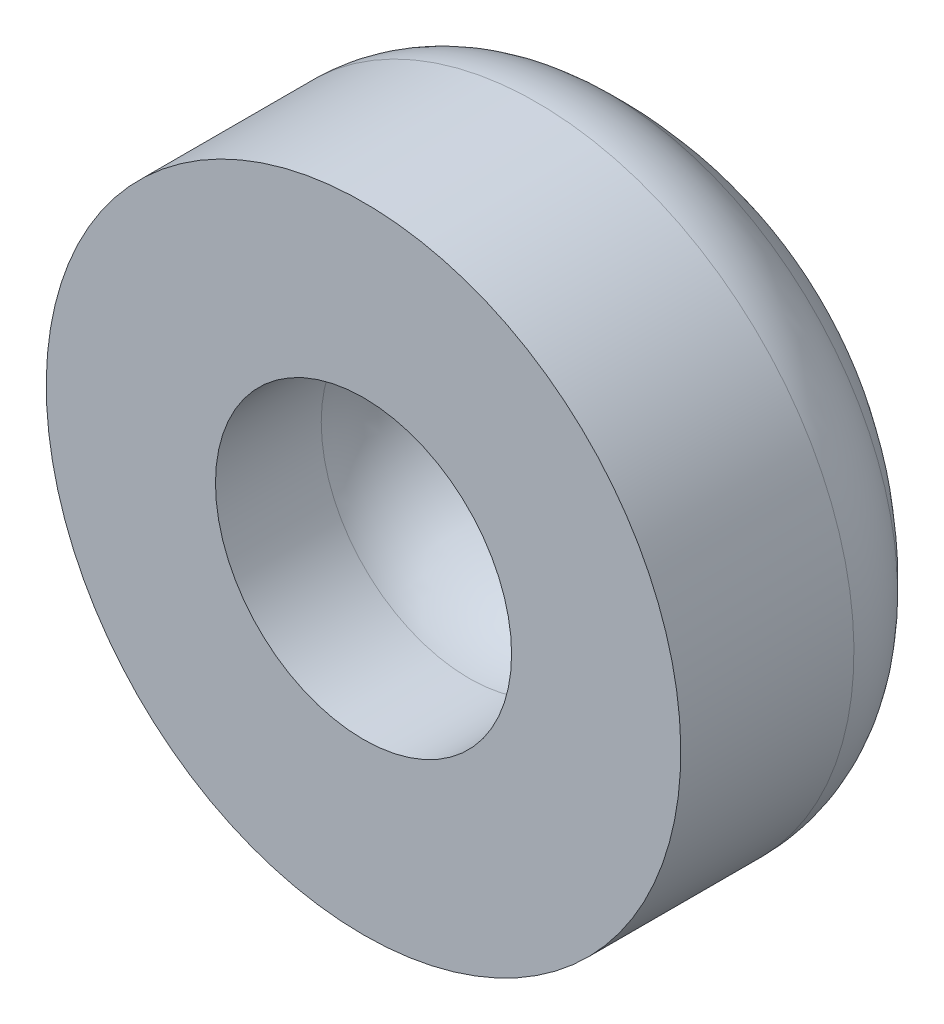
ISO-10303-21;
HEADER;
FILE_DESCRIPTION(('STEP AP214'),'2;1');
FILE_NAME('part.step','',(''),(''),'','','');
FILE_SCHEMA(('AUTOMOTIVE_DESIGN { 1 0 10303 214 1 1 1 1 }'));
ENDSEC;
DATA;
#1=APPLICATION_CONTEXT('core data for automotive mechanical design processes');
#2=APPLICATION_PROTOCOL_DEFINITION('international standard','automotive_design',2000,#1);
#3=PRODUCT_CONTEXT('',#1,'mechanical');
#4=PRODUCT('Part','Part','',(#3));
#5=PRODUCT_RELATED_PRODUCT_CATEGORY('part','',(#4));
#6=PRODUCT_DEFINITION_FORMATION('','',#4);
#7=PRODUCT_DEFINITION_CONTEXT('part definition',#1,'design');
#8=PRODUCT_DEFINITION('design','',#6,#7);
#9=PRODUCT_DEFINITION_SHAPE('','',#8);
#10=(LENGTH_UNIT() NAMED_UNIT(*) SI_UNIT(.MILLI.,.METRE.));
#11=(NAMED_UNIT(*) PLANE_ANGLE_UNIT() SI_UNIT($,.RADIAN.));
#12=(NAMED_UNIT(*) SI_UNIT($,.STERADIAN.) SOLID_ANGLE_UNIT());
#13=UNCERTAINTY_MEASURE_WITH_UNIT(LENGTH_MEASURE(1.E-05),#10,'distance_accuracy_value','');
#14=(GEOMETRIC_REPRESENTATION_CONTEXT(3) GLOBAL_UNCERTAINTY_ASSIGNED_CONTEXT((#13)) GLOBAL_UNIT_ASSIGNED_CONTEXT((#10,
#11,#12)) REPRESENTATION_CONTEXT('',''));
#15=CARTESIAN_POINT('',(0.,0.,0.));
#16=DIRECTION('',(0.,0.,1.));
#17=DIRECTION('',(1.,0.,0.));
#18=AXIS2_PLACEMENT_3D('',#15,#16,#17);
#19=CARTESIAN_POINT('',(0.,0.,2.));
#20=DIRECTION('',(0.,0.,1.));
#21=DIRECTION('',(1.,0.,0.));
#22=AXIS2_PLACEMENT_3D('',#19,#20,#21);
#23=PLANE('',#22);
#24=CARTESIAN_POINT('',(0.,0.,2.));
#25=DIRECTION('',(0.,0.,1.));
#26=DIRECTION('',(1.,0.,0.));
#27=AXIS2_PLACEMENT_3D('',#24,#25,#26);
#28=CIRCLE('',#27,1.4);
#29=CARTESIAN_POINT('',(1.4,0.,2.));
#30=VERTEX_POINT('',#29);
#31=EDGE_CURVE('E50',#30,#30,#28,.T.);
#32=ORIENTED_EDGE('',*,*,#31,.F.);
#33=EDGE_LOOP('',(#32));
#34=FACE_BOUND('',#33,.T.);
#35=CARTESIAN_POINT('',(0.,0.,2.));
#36=DIRECTION('',(0.,0.,1.));
#37=DIRECTION('',(0.,-1.,0.));
#38=AXIS2_PLACEMENT_3D('',#35,#36,#37);
#39=CIRCLE('',#38,3.);
#40=CARTESIAN_POINT('',(0.,-3.,2.));
#41=VERTEX_POINT('',#40);
#42=EDGE_CURVE('E53',#41,#41,#39,.T.);
#43=ORIENTED_EDGE('',*,*,#42,.T.);
#44=EDGE_LOOP('',(#43));
#45=FACE_BOUND('',#44,.T.);
#46=ADVANCED_FACE('F30',(#34,#45),#23,.T.);
#47=CARTESIAN_POINT('',(0.,0.,2.));
#48=DIRECTION('',(0.,0.,-1.));
#49=DIRECTION('',(-1.,0.,0.));
#50=AXIS2_PLACEMENT_3D('',#47,#48,#49);
#51=CYLINDRICAL_SURFACE('',#50,1.4);
#52=CARTESIAN_POINT('',(0.,0.,1.));
#53=DIRECTION('',(0.,0.,-1.));
#54=DIRECTION('',(-1.,0.,0.));
#55=AXIS2_PLACEMENT_3D('',#52,#53,#54);
#56=CIRCLE('',#55,1.4);
#57=CARTESIAN_POINT('',(-1.4,0.,1.));
#58=VERTEX_POINT('',#57);
#59=EDGE_CURVE('E41',#58,#58,#56,.T.);
#60=ORIENTED_EDGE('',*,*,#59,.T.);
#61=EDGE_LOOP('',(#60));
#62=FACE_BOUND('',#61,.T.);
#63=ORIENTED_EDGE('',*,*,#31,.T.);
#64=EDGE_LOOP('',(#63));
#65=FACE_BOUND('',#64,.T.);
#66=ADVANCED_FACE('F70',(#62,#65),#51,.F.);
#67=CARTESIAN_POINT('',(-3.,4.,0.));
#68=DIRECTION('',(0.,0.,-1.));
#69=DIRECTION('',(-1.,0.,0.));
#70=AXIS2_PLACEMENT_3D('',#67,#68,#69);
#71=PLANE('',#70);
#72=CARTESIAN_POINT('',(0.,0.,0.));
#73=DIRECTION('',(0.,0.,-1.));
#74=DIRECTION('',(-1.,0.,0.));
#75=AXIS2_PLACEMENT_3D('',#72,#73,#74);
#76=CIRCLE('',#75,0.4);
#77=CARTESIAN_POINT('',(-0.4,0.,0.));
#78=VERTEX_POINT('',#77);
#79=EDGE_CURVE('E45',#78,#78,#76,.F.);
#80=ORIENTED_EDGE('',*,*,#79,.T.);
#81=EDGE_LOOP('',(#80));
#82=FACE_BOUND('',#81,.T.);
#83=ADVANCED_FACE('F76',(#82),#71,.F.);
#84=CARTESIAN_POINT('',(0.,0.,1.));
#85=DIRECTION('',(0.,0.,-1.));
#86=DIRECTION('',(-1.,0.,0.));
#87=AXIS2_PLACEMENT_3D('',#84,#85,#86);
#88=DEGENERATE_TOROIDAL_SURFACE('',#87,0.4,1.,.T.);
#89=ORIENTED_EDGE('',*,*,#59,.F.);
#90=EDGE_LOOP('',(#89));
#91=FACE_BOUND('',#90,.T.);
#92=ORIENTED_EDGE('',*,*,#79,.F.);
#93=EDGE_LOOP('',(#92));
#94=FACE_BOUND('',#93,.T.);
#95=ADVANCED_FACE('F67',(#91,#94),#88,.F.);
#96=CARTESIAN_POINT('',(0.,0.,2.25));
#97=DIRECTION('',(0.,0.,1.));
#98=DIRECTION('',(0.,1.,0.));
#99=AXIS2_PLACEMENT_3D('',#96,#97,#98);
#100=SPHERICAL_SURFACE('',#99,3.75);
#101=CARTESIAN_POINT('',(0.,0.,-0.323807193842303));
#102=DIRECTION('',(0.,0.,1.));
#103=DIRECTION('',(0.,-1.,0.));
#104=AXIS2_PLACEMENT_3D('',#101,#102,#103);
#105=CIRCLE('',#104,2.72727272727273);
#106=CARTESIAN_POINT('',(0.,-2.72727272727273,-0.323807193842303));
#107=VERTEX_POINT('',#106);
#108=EDGE_CURVE('E10',#107,#107,#105,.F.);
#109=ORIENTED_EDGE('',*,*,#108,.T.);
#110=EDGE_LOOP('',(#109));
#111=FACE_BOUND('',#110,.T.);
#112=ADVANCED_FACE('F60',(#111),#100,.T.);
#113=CARTESIAN_POINT('',(0.,0.,2.));
#114=DIRECTION('',(0.,0.,1.));
#115=DIRECTION('',(0.,-1.,0.));
#116=AXIS2_PLACEMENT_3D('',#113,#114,#115);
#117=CYLINDRICAL_SURFACE('',#116,3.);
#118=CARTESIAN_POINT('',(0.,0.,0.362541391182312));
#119=DIRECTION('',(0.,0.,1.));
#120=DIRECTION('',(0.,-1.,0.));
#121=AXIS2_PLACEMENT_3D('',#118,#119,#120);
#122=CIRCLE('',#121,3.);
#123=CARTESIAN_POINT('',(0.,-3.,0.362541391182312));
#124=VERTEX_POINT('',#123);
#125=EDGE_CURVE('E37',#124,#124,#122,.T.);
#126=ORIENTED_EDGE('',*,*,#125,.T.);
#127=EDGE_LOOP('',(#126));
#128=FACE_BOUND('',#127,.T.);
#129=ORIENTED_EDGE('',*,*,#42,.F.);
#130=EDGE_LOOP('',(#129));
#131=FACE_BOUND('',#130,.T.);
#132=ADVANCED_FACE('F58',(#128,#131),#117,.T.);
#133=CARTESIAN_POINT('',(0.,0.,0.362541391182312));
#134=DIRECTION('',(0.,0.,1.));
#135=DIRECTION('',(0.,-1.,0.));
#136=AXIS2_PLACEMENT_3D('',#133,#134,#135);
#137=TOROIDAL_SURFACE('',#136,2.,1.);
#138=ORIENTED_EDGE('',*,*,#108,.F.);
#139=EDGE_LOOP('',(#138));
#140=FACE_BOUND('',#139,.T.);
#141=ORIENTED_EDGE('',*,*,#125,.F.);
#142=EDGE_LOOP('',(#141));
#143=FACE_BOUND('',#142,.T.);
#144=ADVANCED_FACE('F32',(#140,#143),#137,.T.);
#145=CLOSED_SHELL('',(#46,#66,#83,#95,#112,#132,#144));
#146=MANIFOLD_SOLID_BREP('B2',#145);
#147=ADVANCED_BREP_SHAPE_REPRESENTATION('',(#18,#146),#14);
#148=SHAPE_DEFINITION_REPRESENTATION(#9,#147);
ENDSEC;
END-ISO-10303-21;
